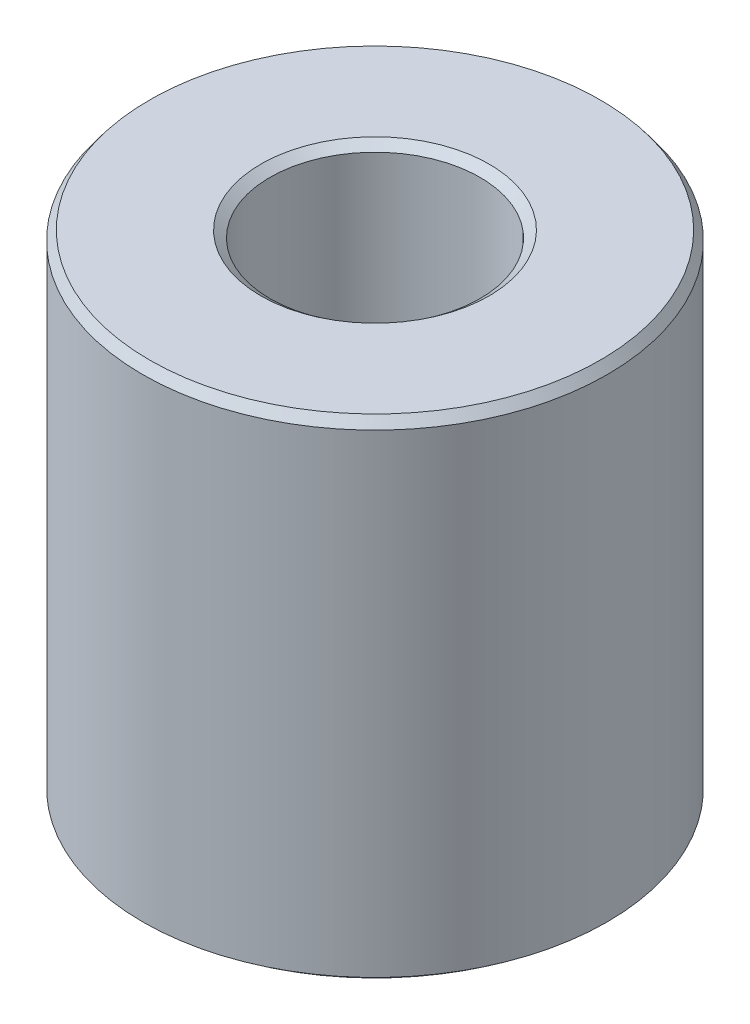
ISO-10303-21;
HEADER;
FILE_DESCRIPTION(('STEP AP214'),'2;1');
FILE_NAME('part.step','',(''),(''),'','','');
FILE_SCHEMA(('AUTOMOTIVE_DESIGN { 1 0 10303 214 1 1 1 1 }'));
ENDSEC;
DATA;
#1=APPLICATION_CONTEXT('core data for automotive mechanical design processes');
#2=APPLICATION_PROTOCOL_DEFINITION('international standard','automotive_design',2000,#1);
#3=PRODUCT_CONTEXT('',#1,'mechanical');
#4=PRODUCT('Part','Part','',(#3));
#5=PRODUCT_RELATED_PRODUCT_CATEGORY('part','',(#4));
#6=PRODUCT_DEFINITION_FORMATION('','',#4);
#7=PRODUCT_DEFINITION_CONTEXT('part definition',#1,'design');
#8=PRODUCT_DEFINITION('design','',#6,#7);
#9=PRODUCT_DEFINITION_SHAPE('','',#8);
#10=(LENGTH_UNIT() NAMED_UNIT(*) SI_UNIT(.MILLI.,.METRE.));
#11=(NAMED_UNIT(*) PLANE_ANGLE_UNIT() SI_UNIT($,.RADIAN.));
#12=(NAMED_UNIT(*) SI_UNIT($,.STERADIAN.) SOLID_ANGLE_UNIT());
#13=UNCERTAINTY_MEASURE_WITH_UNIT(LENGTH_MEASURE(1.E-05),#10,'distance_accuracy_value','');
#14=(GEOMETRIC_REPRESENTATION_CONTEXT(3) GLOBAL_UNCERTAINTY_ASSIGNED_CONTEXT((#13)) GLOBAL_UNIT_ASSIGNED_CONTEXT((#10,
#11,#12)) REPRESENTATION_CONTEXT('',''));
#15=CARTESIAN_POINT('',(0.,0.,0.));
#16=DIRECTION('',(0.,0.,1.));
#17=DIRECTION('',(1.,0.,0.));
#18=AXIS2_PLACEMENT_3D('',#15,#16,#17);
#19=CARTESIAN_POINT('',(0.,121.314895807785,0.));
#20=DIRECTION('',(0.,-1.,0.));
#21=DIRECTION('',(0.,0.,-1.));
#22=AXIS2_PLACEMENT_3D('',#19,#20,#21);
#23=CYLINDRICAL_SURFACE('',#22,57.5);
#24=CARTESIAN_POINT('',(0.,1.71021884010639,0.));
#25=DIRECTION('',(0.,1.,0.));
#26=DIRECTION('',(0.,0.,1.));
#27=AXIS2_PLACEMENT_3D('',#24,#25,#26);
#28=CIRCLE('',#27,57.5);
#29=CARTESIAN_POINT('',(0.,1.71021884010639,57.5));
#30=VERTEX_POINT('',#29);
#31=EDGE_CURVE('E10',#30,#30,#28,.T.);
#32=ORIENTED_EDGE('',*,*,#31,.T.);
#33=EDGE_LOOP('',(#32));
#34=FACE_BOUND('',#33,.T.);
#35=CARTESIAN_POINT('',(0.,119.056169448861,0.));
#36=DIRECTION('',(0.,1.,0.));
#37=DIRECTION('',(0.,0.,1.));
#38=AXIS2_PLACEMENT_3D('',#35,#36,#37);
#39=CIRCLE('',#38,57.5);
#40=CARTESIAN_POINT('',(0.,119.056169448861,57.5));
#41=VERTEX_POINT('',#40);
#42=EDGE_CURVE('E50',#41,#41,#39,.F.);
#43=ORIENTED_EDGE('',*,*,#42,.T.);
#44=EDGE_LOOP('',(#43));
#45=FACE_BOUND('',#44,.T.);
#46=ADVANCED_FACE('F39',(#34,#45),#23,.T.);
#47=CARTESIAN_POINT('',(0.,121.314895807785,0.));
#48=DIRECTION('',(0.,1.,0.));
#49=DIRECTION('',(0.,0.,1.));
#50=AXIS2_PLACEMENT_3D('',#47,#48,#49);
#51=PLANE('',#50);
#52=CARTESIAN_POINT('',(0.,121.314895807785,0.));
#53=DIRECTION('',(0.,1.,0.));
#54=DIRECTION('',(0.,0.,1.));
#55=AXIS2_PLACEMENT_3D('',#52,#53,#54);
#56=CIRCLE('',#55,28.2690241008564);
#57=CARTESIAN_POINT('',(0.,121.314895807785,28.2690241008564));
#58=VERTEX_POINT('',#57);
#59=EDGE_CURVE('E58',#58,#58,#56,.F.);
#60=ORIENTED_EDGE('',*,*,#59,.T.);
#61=EDGE_LOOP('',(#60));
#62=FACE_BOUND('',#61,.T.);
#63=CARTESIAN_POINT('',(0.,121.314895807785,0.));
#64=DIRECTION('',(0.,1.,0.));
#65=DIRECTION('',(0.,0.,1.));
#66=AXIS2_PLACEMENT_3D('',#63,#64,#65);
#67=CIRCLE('',#66,55.7897811598936);
#68=CARTESIAN_POINT('',(0.,121.314895807785,55.7897811598936));
#69=VERTEX_POINT('',#68);
#70=EDGE_CURVE('E61',#69,#69,#67,.T.);
#71=ORIENTED_EDGE('',*,*,#70,.T.);
#72=EDGE_LOOP('',(#71));
#73=FACE_BOUND('',#72,.T.);
#74=ADVANCED_FACE('F88',(#62,#73),#51,.T.);
#75=CARTESIAN_POINT('',(0.,0.,0.));
#76=DIRECTION('',(0.,1.,0.));
#77=DIRECTION('',(0.,0.,1.));
#78=AXIS2_PLACEMENT_3D('',#75,#76,#77);
#79=PLANE('',#78);
#80=CARTESIAN_POINT('',(0.,0.,0.));
#81=DIRECTION('',(0.,1.,0.));
#82=DIRECTION('',(0.,0.,1.));
#83=AXIS2_PLACEMENT_3D('',#80,#81,#82);
#84=CIRCLE('',#83,27.7205165820391);
#85=CARTESIAN_POINT('',(0.,0.,27.7205165820391));
#86=VERTEX_POINT('',#85);
#87=EDGE_CURVE('E51',#86,#86,#84,.T.);
#88=ORIENTED_EDGE('',*,*,#87,.T.);
#89=EDGE_LOOP('',(#88));
#90=FACE_BOUND('',#89,.T.);
#91=CARTESIAN_POINT('',(0.,0.,0.));
#92=DIRECTION('',(0.,1.,0.));
#93=DIRECTION('',(0.,0.,1.));
#94=AXIS2_PLACEMENT_3D('',#91,#92,#93);
#95=CIRCLE('',#94,55.2412736410763);
#96=CARTESIAN_POINT('',(0.,0.,55.2412736410763));
#97=VERTEX_POINT('',#96);
#98=EDGE_CURVE('E54',#97,#97,#95,.F.);
#99=ORIENTED_EDGE('',*,*,#98,.T.);
#100=EDGE_LOOP('',(#99));
#101=FACE_BOUND('',#100,.T.);
#102=ADVANCED_FACE('F83',(#90,#101),#79,.F.);
#103=CARTESIAN_POINT('',(0.,121.314895807785,0.));
#104=DIRECTION('',(0.,-1.,0.));
#105=DIRECTION('',(0.,0.,-1.));
#106=AXIS2_PLACEMENT_3D('',#103,#104,#105);
#107=CYLINDRICAL_SURFACE('',#106,26.0102977419328);
#108=CARTESIAN_POINT('',(0.,119.604676967678,0.));
#109=DIRECTION('',(0.,1.,0.));
#110=DIRECTION('',(0.,0.,1.));
#111=AXIS2_PLACEMENT_3D('',#108,#109,#110);
#112=CIRCLE('',#111,26.0102977419328);
#113=CARTESIAN_POINT('',(0.,119.604676967678,26.0102977419328));
#114=VERTEX_POINT('',#113);
#115=EDGE_CURVE('E67',#114,#114,#112,.T.);
#116=ORIENTED_EDGE('',*,*,#115,.T.);
#117=EDGE_LOOP('',(#116));
#118=FACE_BOUND('',#117,.T.);
#119=CARTESIAN_POINT('',(0.,2.25872635892366,0.));
#120=DIRECTION('',(0.,1.,0.));
#121=DIRECTION('',(0.,0.,1.));
#122=AXIS2_PLACEMENT_3D('',#119,#120,#121);
#123=CIRCLE('',#122,26.0102977419328);
#124=CARTESIAN_POINT('',(0.,2.25872635892366,26.0102977419328));
#125=VERTEX_POINT('',#124);
#126=EDGE_CURVE('E69',#125,#125,#123,.F.);
#127=ORIENTED_EDGE('',*,*,#126,.T.);
#128=EDGE_LOOP('',(#127));
#129=FACE_BOUND('',#128,.T.);
#130=ADVANCED_FACE('F71',(#118,#129),#107,.F.);
#131=CARTESIAN_POINT('',(0.,119.604676967678,0.));
#132=DIRECTION('',(0.,1.,0.));
#133=DIRECTION('',(0.,0.,1.));
#134=AXIS2_PLACEMENT_3D('',#131,#132,#133);
#135=CONICAL_SURFACE('',#134,26.0102977419328,0.92272809711857);
#136=ORIENTED_EDGE('',*,*,#59,.F.);
#137=EDGE_LOOP('',(#136));
#138=FACE_BOUND('',#137,.T.);
#139=ORIENTED_EDGE('',*,*,#115,.F.);
#140=EDGE_LOOP('',(#139));
#141=FACE_BOUND('',#140,.T.);
#142=ADVANCED_FACE('F77',(#138,#141),#135,.F.);
#143=CARTESIAN_POINT('',(0.,0.,0.));
#144=DIRECTION('',(0.,-1.,0.));
#145=DIRECTION('',(0.,0.,-1.));
#146=AXIS2_PLACEMENT_3D('',#143,#144,#145);
#147=CONICAL_SURFACE('',#146,27.7205165820391,0.648068229676321);
#148=ORIENTED_EDGE('',*,*,#126,.F.);
#149=EDGE_LOOP('',(#148));
#150=FACE_BOUND('',#149,.T.);
#151=ORIENTED_EDGE('',*,*,#87,.F.);
#152=EDGE_LOOP('',(#151));
#153=FACE_BOUND('',#152,.T.);
#154=ADVANCED_FACE('F73',(#150,#153),#147,.F.);
#155=CARTESIAN_POINT('',(0.,1.71021884010639,0.));
#156=DIRECTION('',(0.,1.,0.));
#157=DIRECTION('',(0.,0.,1.));
#158=AXIS2_PLACEMENT_3D('',#155,#156,#157);
#159=CONICAL_SURFACE('',#158,57.5,0.922728097118575);
#160=ORIENTED_EDGE('',*,*,#98,.F.);
#161=EDGE_LOOP('',(#160));
#162=FACE_BOUND('',#161,.T.);
#163=ORIENTED_EDGE('',*,*,#31,.F.);
#164=EDGE_LOOP('',(#163));
#165=FACE_BOUND('',#164,.T.);
#166=ADVANCED_FACE('F76',(#162,#165),#159,.T.);
#167=CARTESIAN_POINT('',(0.,121.314895807785,0.));
#168=DIRECTION('',(0.,-1.,0.));
#169=DIRECTION('',(0.,0.,-1.));
#170=AXIS2_PLACEMENT_3D('',#167,#168,#169);
#171=CONICAL_SURFACE('',#170,55.7897811598936,0.648068229676321);
#172=ORIENTED_EDGE('',*,*,#42,.F.);
#173=EDGE_LOOP('',(#172));
#174=FACE_BOUND('',#173,.T.);
#175=ORIENTED_EDGE('',*,*,#70,.F.);
#176=EDGE_LOOP('',(#175));
#177=FACE_BOUND('',#176,.T.);
#178=ADVANCED_FACE('F45',(#174,#177),#171,.T.);
#179=CLOSED_SHELL('',(#46,#74,#102,#130,#142,#154,#166,#178));
#180=MANIFOLD_SOLID_BREP('B2',#179);
#181=ADVANCED_BREP_SHAPE_REPRESENTATION('',(#18,#180),#14);
#182=SHAPE_DEFINITION_REPRESENTATION(#9,#181);
ENDSEC;
END-ISO-10303-21;
